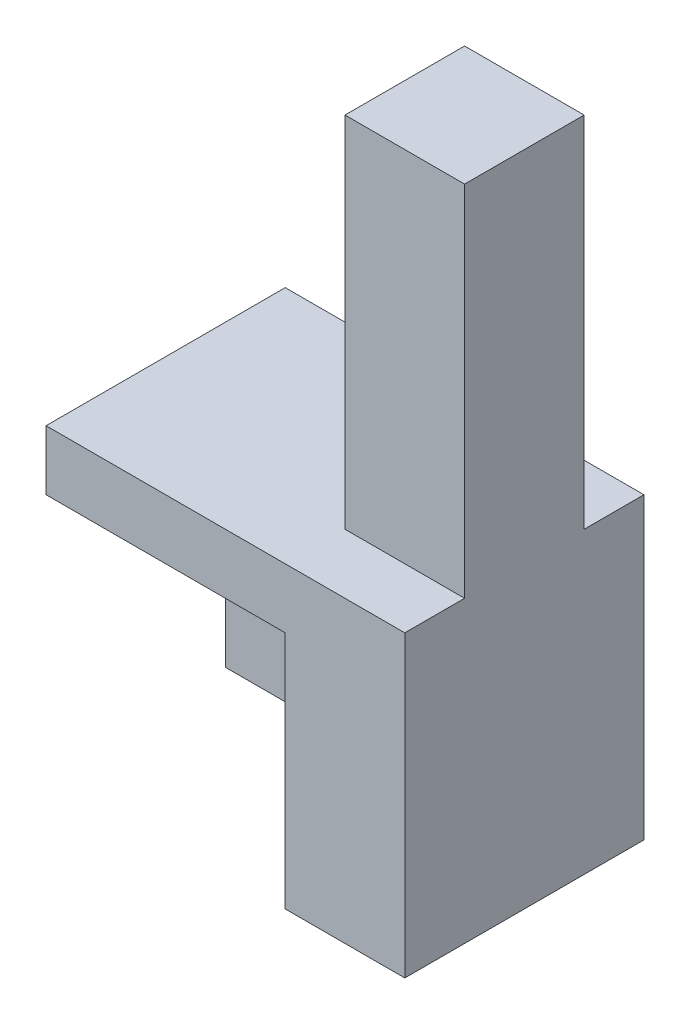
ISO-10303-21;
HEADER;
FILE_DESCRIPTION(('STEP AP214'),'2;1');
FILE_NAME('part.step','',(''),(''),'','','');
FILE_SCHEMA(('AUTOMOTIVE_DESIGN { 1 0 10303 214 1 1 1 1 }'));
ENDSEC;
DATA;
#1=APPLICATION_CONTEXT('core data for automotive mechanical design processes');
#2=APPLICATION_PROTOCOL_DEFINITION('international standard','automotive_design',2000,#1);
#3=PRODUCT_CONTEXT('',#1,'mechanical');
#4=PRODUCT('Part','Part','',(#3));
#5=PRODUCT_RELATED_PRODUCT_CATEGORY('part','',(#4));
#6=PRODUCT_DEFINITION_FORMATION('','',#4);
#7=PRODUCT_DEFINITION_CONTEXT('part definition',#1,'design');
#8=PRODUCT_DEFINITION('design','',#6,#7);
#9=PRODUCT_DEFINITION_SHAPE('','',#8);
#10=(LENGTH_UNIT() NAMED_UNIT(*) SI_UNIT(.MILLI.,.METRE.));
#11=(NAMED_UNIT(*) PLANE_ANGLE_UNIT() SI_UNIT($,.RADIAN.));
#12=(NAMED_UNIT(*) SI_UNIT($,.STERADIAN.) SOLID_ANGLE_UNIT());
#13=UNCERTAINTY_MEASURE_WITH_UNIT(LENGTH_MEASURE(1.E-05),#10,'distance_accuracy_value','');
#14=(GEOMETRIC_REPRESENTATION_CONTEXT(3) GLOBAL_UNCERTAINTY_ASSIGNED_CONTEXT((#13)) GLOBAL_UNIT_ASSIGNED_CONTEXT((#10,
#11,#12)) REPRESENTATION_CONTEXT('',''));
#15=CARTESIAN_POINT('',(0.,0.,0.));
#16=DIRECTION('',(0.,0.,1.));
#17=DIRECTION('',(1.,0.,0.));
#18=AXIS2_PLACEMENT_3D('',#15,#16,#17);
#19=CARTESIAN_POINT('',(0.,0.,0.));
#20=DIRECTION('',(0.,0.,1.));
#21=DIRECTION('',(1.,0.,0.));
#22=AXIS2_PLACEMENT_3D('',#19,#20,#21);
#23=PLANE('',#22);
#24=DIRECTION('',(1.,0.,0.));
#25=VECTOR('',#24,1.);
#26=CARTESIAN_POINT('',(0.,0.,0.));
#27=LINE('',#26,#25);
#28=CARTESIAN_POINT('',(20.,0.,0.));
#29=VERTEX_POINT('',#28);
#30=CARTESIAN_POINT('',(30.,0.,0.));
#31=VERTEX_POINT('',#30);
#32=EDGE_CURVE('E11',#29,#31,#27,.T.);
#33=ORIENTED_EDGE('',*,*,#32,.F.);
#34=DIRECTION('',(0.,-1.,0.));
#35=VECTOR('',#34,1.);
#36=CARTESIAN_POINT('',(20.,0.,0.));
#37=LINE('',#36,#35);
#38=CARTESIAN_POINT('',(20.,30.,0.));
#39=VERTEX_POINT('',#38);
#40=EDGE_CURVE('E210',#39,#29,#37,.T.);
#41=ORIENTED_EDGE('',*,*,#40,.F.);
#42=DIRECTION('',(-1.,0.,0.));
#43=VECTOR('',#42,1.);
#44=CARTESIAN_POINT('',(20.,30.,0.));
#45=LINE('',#44,#43);
#46=CARTESIAN_POINT('',(30.,30.,0.));
#47=VERTEX_POINT('',#46);
#48=EDGE_CURVE('E224',#47,#39,#45,.T.);
#49=ORIENTED_EDGE('',*,*,#48,.F.);
#50=DIRECTION('',(0.,1.,0.));
#51=VECTOR('',#50,1.);
#52=CARTESIAN_POINT('',(30.,30.,0.));
#53=LINE('',#52,#51);
#54=EDGE_CURVE('E221',#31,#47,#53,.T.);
#55=ORIENTED_EDGE('',*,*,#54,.F.);
#56=EDGE_LOOP('',(#33,#41,#49,#55));
#57=FACE_BOUND('',#56,.T.);
#58=ADVANCED_FACE('F45',(#57),#23,.F.);
#59=CARTESIAN_POINT('',(0.,0.,10.));
#60=DIRECTION('',(0.,-1.,0.));
#61=DIRECTION('',(0.,0.,-1.));
#62=AXIS2_PLACEMENT_3D('',#59,#60,#61);
#63=PLANE('',#62);
#64=DIRECTION('',(0.,0.,-1.));
#65=VECTOR('',#64,1.);
#66=CARTESIAN_POINT('',(20.,0.,10.));
#67=LINE('',#66,#65);
#68=CARTESIAN_POINT('',(20.,0.,10.));
#69=VERTEX_POINT('',#68);
#70=EDGE_CURVE('E215',#69,#29,#67,.T.);
#71=ORIENTED_EDGE('',*,*,#70,.T.);
#72=ORIENTED_EDGE('',*,*,#32,.T.);
#73=DIRECTION('',(0.,0.,1.));
#74=VECTOR('',#73,1.);
#75=CARTESIAN_POINT('',(30.,0.,-5.));
#76=LINE('',#75,#74);
#77=CARTESIAN_POINT('',(30.,0.,-5.));
#78=VERTEX_POINT('',#77);
#79=EDGE_CURVE('E202',#78,#31,#76,.T.);
#80=ORIENTED_EDGE('',*,*,#79,.F.);
#81=DIRECTION('',(1.,0.,0.));
#82=VECTOR('',#81,1.);
#83=CARTESIAN_POINT('',(0.,0.,-5.));
#84=LINE('',#83,#82);
#85=CARTESIAN_POINT('',(0.,0.,-5.));
#86=VERTEX_POINT('',#85);
#87=EDGE_CURVE('E140',#86,#78,#84,.T.);
#88=ORIENTED_EDGE('',*,*,#87,.F.);
#89=DIRECTION('',(0.,0.,-1.));
#90=VECTOR('',#89,1.);
#91=CARTESIAN_POINT('',(0.,0.,10.));
#92=LINE('',#91,#90);
#93=CARTESIAN_POINT('',(0.,0.,15.));
#94=VERTEX_POINT('',#93);
#95=EDGE_CURVE('E49',#94,#86,#92,.T.);
#96=ORIENTED_EDGE('',*,*,#95,.F.);
#97=DIRECTION('',(-1.,0.,0.));
#98=VECTOR('',#97,1.);
#99=CARTESIAN_POINT('',(30.,0.,15.));
#100=LINE('',#99,#98);
#101=CARTESIAN_POINT('',(30.,0.,15.));
#102=VERTEX_POINT('',#101);
#103=EDGE_CURVE('E138',#102,#94,#100,.T.);
#104=ORIENTED_EDGE('',*,*,#103,.F.);
#105=DIRECTION('',(0.,0.,-1.));
#106=VECTOR('',#105,1.);
#107=CARTESIAN_POINT('',(30.,0.,15.));
#108=LINE('',#107,#106);
#109=CARTESIAN_POINT('',(30.,0.,10.));
#110=VERTEX_POINT('',#109);
#111=EDGE_CURVE('E176',#102,#110,#108,.T.);
#112=ORIENTED_EDGE('',*,*,#111,.T.);
#113=DIRECTION('',(-1.,0.,0.));
#114=VECTOR('',#113,1.);
#115=CARTESIAN_POINT('',(30.,0.,10.));
#116=LINE('',#115,#114);
#117=EDGE_CURVE('E62',#110,#69,#116,.T.);
#118=ORIENTED_EDGE('',*,*,#117,.T.);
#119=EDGE_LOOP('',(#71,#72,#80,#88,#96,#104,#112,#118));
#120=FACE_BOUND('',#119,.T.);
#121=ADVANCED_FACE('F47',(#120),#63,.F.);
#122=CARTESIAN_POINT('',(0.,0.,10.));
#123=DIRECTION('',(1.,0.,0.));
#124=DIRECTION('',(0.,1.,0.));
#125=AXIS2_PLACEMENT_3D('',#122,#123,#124);
#126=PLANE('',#125);
#127=ORIENTED_EDGE('',*,*,#95,.T.);
#128=DIRECTION('',(0.,1.,0.));
#129=VECTOR('',#128,1.);
#130=CARTESIAN_POINT('',(0.,0.,-5.));
#131=LINE('',#130,#129);
#132=CARTESIAN_POINT('',(0.,-25.,-5.));
#133=VERTEX_POINT('',#132);
#134=EDGE_CURVE('E181',#133,#86,#131,.T.);
#135=ORIENTED_EDGE('',*,*,#134,.F.);
#136=DIRECTION('',(0.,0.,1.));
#137=VECTOR('',#136,1.);
#138=CARTESIAN_POINT('',(0.,-25.,-5.));
#139=LINE('',#138,#137);
#140=CARTESIAN_POINT('',(0.,-25.,0.));
#141=VERTEX_POINT('',#140);
#142=EDGE_CURVE('E194',#133,#141,#139,.T.);
#143=ORIENTED_EDGE('',*,*,#142,.T.);
#144=DIRECTION('',(0.,1.,0.));
#145=VECTOR('',#144,1.);
#146=CARTESIAN_POINT('',(0.,0.,0.));
#147=LINE('',#146,#145);
#148=CARTESIAN_POINT('',(0.,-5.,0.));
#149=VERTEX_POINT('',#148);
#150=EDGE_CURVE('E180',#141,#149,#147,.T.);
#151=ORIENTED_EDGE('',*,*,#150,.T.);
#152=DIRECTION('',(0.,0.,-1.));
#153=VECTOR('',#152,1.);
#154=CARTESIAN_POINT('',(0.,-5.,10.));
#155=LINE('',#154,#153);
#156=CARTESIAN_POINT('',(0.,-5.,15.));
#157=VERTEX_POINT('',#156);
#158=EDGE_CURVE('E145',#157,#149,#155,.T.);
#159=ORIENTED_EDGE('',*,*,#158,.F.);
#160=DIRECTION('',(0.,-1.,0.));
#161=VECTOR('',#160,1.);
#162=CARTESIAN_POINT('',(0.,0.,15.));
#163=LINE('',#162,#161);
#164=EDGE_CURVE('E147',#94,#157,#163,.T.);
#165=ORIENTED_EDGE('',*,*,#164,.F.);
#166=EDGE_LOOP('',(#127,#135,#143,#151,#159,#165));
#167=FACE_BOUND('',#166,.T.);
#168=ADVANCED_FACE('F148',(#167),#126,.F.);
#169=CARTESIAN_POINT('',(0.,-5.,10.));
#170=DIRECTION('',(0.,1.,0.));
#171=DIRECTION('',(0.,0.,1.));
#172=AXIS2_PLACEMENT_3D('',#169,#170,#171);
#173=PLANE('',#172);
#174=DIRECTION('',(1.,0.,0.));
#175=VECTOR('',#174,1.);
#176=CARTESIAN_POINT('',(0.,-5.,0.));
#177=LINE('',#176,#175);
#178=CARTESIAN_POINT('',(20.,-5.,0.));
#179=VERTEX_POINT('',#178);
#180=EDGE_CURVE('E206',#149,#179,#177,.T.);
#181=ORIENTED_EDGE('',*,*,#180,.T.);
#182=DIRECTION('',(0.,0.,-1.));
#183=VECTOR('',#182,1.);
#184=CARTESIAN_POINT('',(20.,-5.,10.));
#185=LINE('',#184,#183);
#186=CARTESIAN_POINT('',(20.,-5.,15.));
#187=VERTEX_POINT('',#186);
#188=EDGE_CURVE('E246',#187,#179,#185,.T.);
#189=ORIENTED_EDGE('',*,*,#188,.F.);
#190=DIRECTION('',(1.,0.,0.));
#191=VECTOR('',#190,1.);
#192=CARTESIAN_POINT('',(0.,-5.,15.));
#193=LINE('',#192,#191);
#194=EDGE_CURVE('E154',#157,#187,#193,.T.);
#195=ORIENTED_EDGE('',*,*,#194,.F.);
#196=ORIENTED_EDGE('',*,*,#158,.T.);
#197=EDGE_LOOP('',(#181,#189,#195,#196));
#198=FACE_BOUND('',#197,.T.);
#199=ADVANCED_FACE('F252',(#198),#173,.F.);
#200=CARTESIAN_POINT('',(20.,-5.,10.));
#201=DIRECTION('',(1.,0.,0.));
#202=DIRECTION('',(0.,0.,-1.));
#203=AXIS2_PLACEMENT_3D('',#200,#201,#202);
#204=PLANE('',#203);
#205=DIRECTION('',(0.,-1.,0.));
#206=VECTOR('',#205,1.);
#207=CARTESIAN_POINT('',(20.,-5.,0.));
#208=LINE('',#207,#206);
#209=CARTESIAN_POINT('',(20.,-25.,0.));
#210=VERTEX_POINT('',#209);
#211=EDGE_CURVE('E218',#179,#210,#208,.T.);
#212=ORIENTED_EDGE('',*,*,#211,.T.);
#213=DIRECTION('',(0.,0.,-1.));
#214=VECTOR('',#213,1.);
#215=CARTESIAN_POINT('',(20.,-25.,10.));
#216=LINE('',#215,#214);
#217=CARTESIAN_POINT('',(20.,-25.,15.));
#218=VERTEX_POINT('',#217);
#219=EDGE_CURVE('E242',#218,#210,#216,.T.);
#220=ORIENTED_EDGE('',*,*,#219,.F.);
#221=DIRECTION('',(0.,-1.,0.));
#222=VECTOR('',#221,1.);
#223=CARTESIAN_POINT('',(20.,-5.,15.));
#224=LINE('',#223,#222);
#225=EDGE_CURVE('E168',#187,#218,#224,.T.);
#226=ORIENTED_EDGE('',*,*,#225,.F.);
#227=ORIENTED_EDGE('',*,*,#188,.T.);
#228=EDGE_LOOP('',(#212,#220,#226,#227));
#229=FACE_BOUND('',#228,.T.);
#230=ADVANCED_FACE('F265',(#229),#204,.F.);
#231=CARTESIAN_POINT('',(30.,-25.,10.));
#232=DIRECTION('',(0.,1.,0.));
#233=DIRECTION('',(0.,0.,1.));
#234=AXIS2_PLACEMENT_3D('',#231,#232,#233);
#235=PLANE('',#234);
#236=ORIENTED_EDGE('',*,*,#219,.T.);
#237=DIRECTION('',(-1.,0.,0.));
#238=VECTOR('',#237,1.);
#239=CARTESIAN_POINT('',(0.,-25.,0.));
#240=LINE('',#239,#238);
#241=EDGE_CURVE('E184',#210,#141,#240,.T.);
#242=ORIENTED_EDGE('',*,*,#241,.T.);
#243=ORIENTED_EDGE('',*,*,#142,.F.);
#244=DIRECTION('',(-1.,0.,0.));
#245=VECTOR('',#244,1.);
#246=CARTESIAN_POINT('',(0.,-25.,-5.));
#247=LINE('',#246,#245);
#248=CARTESIAN_POINT('',(30.,-25.,-5.));
#249=VERTEX_POINT('',#248);
#250=EDGE_CURVE('E191',#249,#133,#247,.T.);
#251=ORIENTED_EDGE('',*,*,#250,.F.);
#252=DIRECTION('',(0.,0.,-1.));
#253=VECTOR('',#252,1.);
#254=CARTESIAN_POINT('',(30.,-25.,10.));
#255=LINE('',#254,#253);
#256=CARTESIAN_POINT('',(30.,-25.,15.));
#257=VERTEX_POINT('',#256);
#258=EDGE_CURVE('E239',#257,#249,#255,.T.);
#259=ORIENTED_EDGE('',*,*,#258,.F.);
#260=DIRECTION('',(1.,0.,0.));
#261=VECTOR('',#260,1.);
#262=CARTESIAN_POINT('',(20.,-25.,15.));
#263=LINE('',#262,#261);
#264=EDGE_CURVE('E172',#218,#257,#263,.T.);
#265=ORIENTED_EDGE('',*,*,#264,.F.);
#266=EDGE_LOOP('',(#236,#242,#243,#251,#259,#265));
#267=FACE_BOUND('',#266,.T.);
#268=ADVANCED_FACE('F261',(#267),#235,.F.);
#269=CARTESIAN_POINT('',(30.,30.,10.));
#270=DIRECTION('',(-1.,0.,0.));
#271=DIRECTION('',(0.,0.,1.));
#272=AXIS2_PLACEMENT_3D('',#269,#270,#271);
#273=PLANE('',#272);
#274=ORIENTED_EDGE('',*,*,#258,.T.);
#275=DIRECTION('',(0.,-1.,0.));
#276=VECTOR('',#275,1.);
#277=CARTESIAN_POINT('',(30.,0.,-5.));
#278=LINE('',#277,#276);
#279=EDGE_CURVE('E187',#78,#249,#278,.T.);
#280=ORIENTED_EDGE('',*,*,#279,.F.);
#281=ORIENTED_EDGE('',*,*,#79,.T.);
#282=ORIENTED_EDGE('',*,*,#54,.T.);
#283=DIRECTION('',(0.,0.,-1.));
#284=VECTOR('',#283,1.);
#285=CARTESIAN_POINT('',(30.,30.,10.));
#286=LINE('',#285,#284);
#287=CARTESIAN_POINT('',(30.,30.,10.));
#288=VERTEX_POINT('',#287);
#289=EDGE_CURVE('E235',#288,#47,#286,.T.);
#290=ORIENTED_EDGE('',*,*,#289,.F.);
#291=DIRECTION('',(0.,1.,0.));
#292=VECTOR('',#291,1.);
#293=CARTESIAN_POINT('',(30.,30.,10.));
#294=LINE('',#293,#292);
#295=EDGE_CURVE('E95',#110,#288,#294,.T.);
#296=ORIENTED_EDGE('',*,*,#295,.F.);
#297=ORIENTED_EDGE('',*,*,#111,.F.);
#298=DIRECTION('',(0.,1.,0.));
#299=VECTOR('',#298,1.);
#300=CARTESIAN_POINT('',(30.,-25.,15.));
#301=LINE('',#300,#299);
#302=EDGE_CURVE('E159',#257,#102,#301,.T.);
#303=ORIENTED_EDGE('',*,*,#302,.F.);
#304=EDGE_LOOP('',(#274,#280,#281,#282,#290,#296,#297,#303));
#305=FACE_BOUND('',#304,.T.);
#306=ADVANCED_FACE('F267',(#305),#273,.F.);
#307=CARTESIAN_POINT('',(20.,30.,10.));
#308=DIRECTION('',(0.,-1.,0.));
#309=DIRECTION('',(0.,0.,-1.));
#310=AXIS2_PLACEMENT_3D('',#307,#308,#309);
#311=PLANE('',#310);
#312=ORIENTED_EDGE('',*,*,#48,.T.);
#313=DIRECTION('',(0.,0.,-1.));
#314=VECTOR('',#313,1.);
#315=CARTESIAN_POINT('',(20.,30.,10.));
#316=LINE('',#315,#314);
#317=CARTESIAN_POINT('',(20.,30.,10.));
#318=VERTEX_POINT('',#317);
#319=EDGE_CURVE('E231',#318,#39,#316,.T.);
#320=ORIENTED_EDGE('',*,*,#319,.F.);
#321=DIRECTION('',(-1.,0.,0.));
#322=VECTOR('',#321,1.);
#323=CARTESIAN_POINT('',(20.,30.,10.));
#324=LINE('',#323,#322);
#325=EDGE_CURVE('E209',#288,#318,#324,.T.);
#326=ORIENTED_EDGE('',*,*,#325,.F.);
#327=ORIENTED_EDGE('',*,*,#289,.T.);
#328=EDGE_LOOP('',(#312,#320,#326,#327));
#329=FACE_BOUND('',#328,.T.);
#330=ADVANCED_FACE('F274',(#329),#311,.F.);
#331=CARTESIAN_POINT('',(20.,0.,10.));
#332=DIRECTION('',(1.,0.,0.));
#333=DIRECTION('',(0.,0.,-1.));
#334=AXIS2_PLACEMENT_3D('',#331,#332,#333);
#335=PLANE('',#334);
#336=ORIENTED_EDGE('',*,*,#40,.T.);
#337=ORIENTED_EDGE('',*,*,#70,.F.);
#338=DIRECTION('',(0.,-1.,0.));
#339=VECTOR('',#338,1.);
#340=CARTESIAN_POINT('',(20.,0.,10.));
#341=LINE('',#340,#339);
#342=EDGE_CURVE('E68',#318,#69,#341,.T.);
#343=ORIENTED_EDGE('',*,*,#342,.F.);
#344=ORIENTED_EDGE('',*,*,#319,.T.);
#345=EDGE_LOOP('',(#336,#337,#343,#344));
#346=FACE_BOUND('',#345,.T.);
#347=ADVANCED_FACE('F270',(#346),#335,.F.);
#348=CARTESIAN_POINT('',(0.,0.,10.));
#349=DIRECTION('',(0.,0.,1.));
#350=DIRECTION('',(1.,0.,0.));
#351=AXIS2_PLACEMENT_3D('',#348,#349,#350);
#352=PLANE('',#351);
#353=ORIENTED_EDGE('',*,*,#117,.F.);
#354=ORIENTED_EDGE('',*,*,#295,.T.);
#355=ORIENTED_EDGE('',*,*,#325,.T.);
#356=ORIENTED_EDGE('',*,*,#342,.T.);
#357=EDGE_LOOP('',(#353,#354,#355,#356));
#358=FACE_BOUND('',#357,.T.);
#359=ADVANCED_FACE('F286',(#358),#352,.T.);
#360=CARTESIAN_POINT('',(0.,0.,0.));
#361=DIRECTION('',(0.,0.,1.));
#362=DIRECTION('',(1.,0.,0.));
#363=AXIS2_PLACEMENT_3D('',#360,#361,#362);
#364=PLANE('',#363);
#365=ORIENTED_EDGE('',*,*,#211,.F.);
#366=ORIENTED_EDGE('',*,*,#180,.F.);
#367=ORIENTED_EDGE('',*,*,#150,.F.);
#368=ORIENTED_EDGE('',*,*,#241,.F.);
#369=EDGE_LOOP('',(#365,#366,#367,#368));
#370=FACE_BOUND('',#369,.T.);
#371=ADVANCED_FACE('F256',(#370),#364,.T.);
#372=CARTESIAN_POINT('',(0.,0.,-5.));
#373=DIRECTION('',(0.,0.,1.));
#374=DIRECTION('',(1.,0.,0.));
#375=AXIS2_PLACEMENT_3D('',#372,#373,#374);
#376=PLANE('',#375);
#377=ORIENTED_EDGE('',*,*,#134,.T.);
#378=ORIENTED_EDGE('',*,*,#87,.T.);
#379=ORIENTED_EDGE('',*,*,#279,.T.);
#380=ORIENTED_EDGE('',*,*,#250,.T.);
#381=EDGE_LOOP('',(#377,#378,#379,#380));
#382=FACE_BOUND('',#381,.T.);
#383=ADVANCED_FACE('F277',(#382),#376,.F.);
#384=CARTESIAN_POINT('',(0.,0.,15.));
#385=DIRECTION('',(0.,0.,1.));
#386=DIRECTION('',(1.,0.,0.));
#387=AXIS2_PLACEMENT_3D('',#384,#385,#386);
#388=PLANE('',#387);
#389=ORIENTED_EDGE('',*,*,#103,.T.);
#390=ORIENTED_EDGE('',*,*,#164,.T.);
#391=ORIENTED_EDGE('',*,*,#194,.T.);
#392=ORIENTED_EDGE('',*,*,#225,.T.);
#393=ORIENTED_EDGE('',*,*,#264,.T.);
#394=ORIENTED_EDGE('',*,*,#302,.T.);
#395=EDGE_LOOP('',(#389,#390,#391,#392,#393,#394));
#396=FACE_BOUND('',#395,.T.);
#397=ADVANCED_FACE('F156',(#396),#388,.T.);
#398=CLOSED_SHELL('',(#58,#121,#168,#199,#230,#268,#306,#330,#347,#359,#371,#383,#397));
#399=MANIFOLD_SOLID_BREP('B2',#398);
#400=ADVANCED_BREP_SHAPE_REPRESENTATION('',(#18,#399),#14);
#401=SHAPE_DEFINITION_REPRESENTATION(#9,#400);
ENDSEC;
END-ISO-10303-21;
